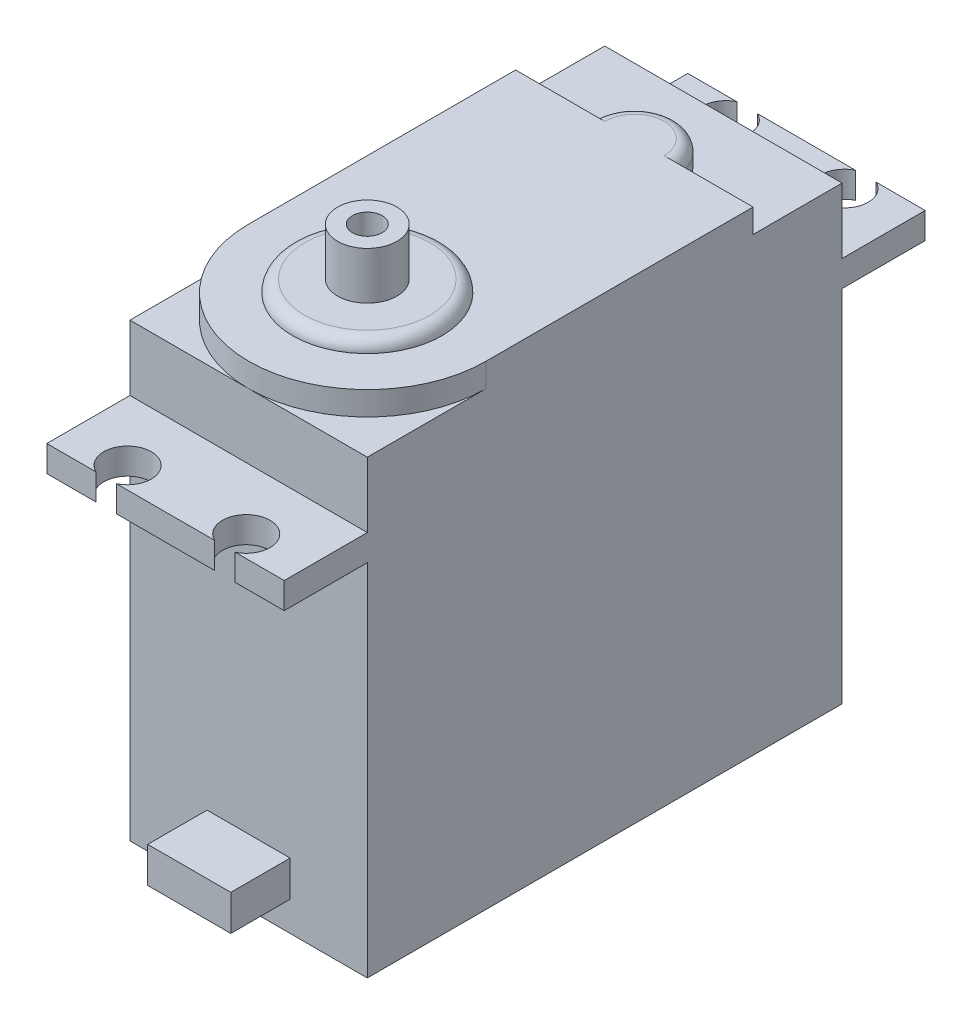
ISO-10303-21;
HEADER;
FILE_DESCRIPTION(('STEP AP214'),'2;1');
FILE_NAME('part.step','',(''),(''),'','','');
FILE_SCHEMA(('AUTOMOTIVE_DESIGN { 1 0 10303 214 1 1 1 1 }'));
ENDSEC;
DATA;
#1=APPLICATION_CONTEXT('core data for automotive mechanical design processes');
#2=APPLICATION_PROTOCOL_DEFINITION('international standard','automotive_design',2000,#1);
#3=PRODUCT_CONTEXT('',#1,'mechanical');
#4=PRODUCT('Part','Part','',(#3));
#5=PRODUCT_RELATED_PRODUCT_CATEGORY('part','',(#4));
#6=PRODUCT_DEFINITION_FORMATION('','',#4);
#7=PRODUCT_DEFINITION_CONTEXT('part definition',#1,'design');
#8=PRODUCT_DEFINITION('design','',#6,#7);
#9=PRODUCT_DEFINITION_SHAPE('','',#8);
#10=(LENGTH_UNIT() NAMED_UNIT(*) SI_UNIT(.MILLI.,.METRE.));
#11=(NAMED_UNIT(*) PLANE_ANGLE_UNIT() SI_UNIT($,.RADIAN.));
#12=(NAMED_UNIT(*) SI_UNIT($,.STERADIAN.) SOLID_ANGLE_UNIT());
#13=UNCERTAINTY_MEASURE_WITH_UNIT(LENGTH_MEASURE(1.E-05),#10,'distance_accuracy_value','');
#14=(GEOMETRIC_REPRESENTATION_CONTEXT(3) GLOBAL_UNCERTAINTY_ASSIGNED_CONTEXT((#13)) GLOBAL_UNIT_ASSIGNED_CONTEXT((#10,
#11,#12)) REPRESENTATION_CONTEXT('',''));
#15=CARTESIAN_POINT('',(0.,0.,0.));
#16=DIRECTION('',(0.,0.,1.));
#17=DIRECTION('',(1.,0.,0.));
#18=AXIS2_PLACEMENT_3D('',#15,#16,#17);
#19=CARTESIAN_POINT('',(0.,38.,0.));
#20=DIRECTION('',(0.,-1.,0.));
#21=DIRECTION('',(0.,0.,-1.));
#22=AXIS2_PLACEMENT_3D('',#19,#20,#21);
#23=PLANE('',#22);
#24=DIRECTION('',(-1.,0.,0.));
#25=VECTOR('',#24,1.);
#26=CARTESIAN_POINT('',(20.,38.,-32.5));
#27=LINE('',#26,#25);
#28=CARTESIAN_POINT('',(20.,38.,-32.5));
#29=VERTEX_POINT('',#28);
#30=CARTESIAN_POINT('',(13.5,38.,-32.5));
#31=VERTEX_POINT('',#30);
#32=EDGE_CURVE('E446',#29,#31,#27,.T.);
#33=ORIENTED_EDGE('',*,*,#32,.F.);
#34=DIRECTION('',(0.,0.,-1.));
#35=VECTOR('',#34,1.);
#36=CARTESIAN_POINT('',(20.,38.,0.));
#37=LINE('',#36,#35);
#38=CARTESIAN_POINT('',(20.,38.,-40.));
#39=VERTEX_POINT('',#38);
#40=EDGE_CURVE('E266',#29,#39,#37,.T.);
#41=ORIENTED_EDGE('',*,*,#40,.T.);
#42=DIRECTION('',(-1.,0.,0.));
#43=VECTOR('',#42,1.);
#44=CARTESIAN_POINT('',(0.,38.,-40.));
#45=LINE('',#44,#43);
#46=CARTESIAN_POINT('',(0.,38.,-40.));
#47=VERTEX_POINT('',#46);
#48=EDGE_CURVE('E395',#39,#47,#45,.T.);
#49=ORIENTED_EDGE('',*,*,#48,.T.);
#50=DIRECTION('',(0.,0.,1.));
#51=VECTOR('',#50,1.);
#52=CARTESIAN_POINT('',(0.,38.,0.));
#53=LINE('',#52,#51);
#54=CARTESIAN_POINT('',(0.,38.,-32.5));
#55=VERTEX_POINT('',#54);
#56=EDGE_CURVE('E386',#47,#55,#53,.T.);
#57=ORIENTED_EDGE('',*,*,#56,.T.);
#58=DIRECTION('',(-1.,0.,0.));
#59=VECTOR('',#58,1.);
#60=CARTESIAN_POINT('',(6.5,38.,-32.5));
#61=LINE('',#60,#59);
#62=CARTESIAN_POINT('',(6.5,38.,-32.5));
#63=VERTEX_POINT('',#62);
#64=EDGE_CURVE('E498',#63,#55,#61,.T.);
#65=ORIENTED_EDGE('',*,*,#64,.F.);
#66=CARTESIAN_POINT('',(10.,38.,-32.5));
#67=DIRECTION('',(0.,1.,0.));
#68=DIRECTION('',(0.,0.,1.));
#69=AXIS2_PLACEMENT_3D('',#66,#67,#68);
#70=CIRCLE('',#69,3.5);
#71=EDGE_CURVE('E522',#31,#63,#70,.T.);
#72=ORIENTED_EDGE('',*,*,#71,.F.);
#73=EDGE_LOOP('',(#33,#41,#49,#57,#65,#72));
#74=FACE_BOUND('',#73,.T.);
#75=ADVANCED_FACE('F36',(#74),#23,.F.);
#76=CARTESIAN_POINT('',(10.,38.,-10.));
#77=DIRECTION('',(0.,1.,0.));
#78=DIRECTION('',(0.,0.,1.));
#79=AXIS2_PLACEMENT_3D('',#76,#77,#78);
#80=CIRCLE('',#79,10.);
#81=CARTESIAN_POINT('',(0.,38.,-10.));
#82=VERTEX_POINT('',#81);
#83=CARTESIAN_POINT('',(10.,38.,0.));
#84=VERTEX_POINT('',#83);
#85=EDGE_CURVE('E260',#82,#84,#80,.T.);
#86=ORIENTED_EDGE('',*,*,#85,.F.);
#87=CARTESIAN_POINT('',(0.,38.,0.));
#88=VERTEX_POINT('',#87);
#89=EDGE_CURVE('E389',#82,#88,#53,.T.);
#90=ORIENTED_EDGE('',*,*,#89,.T.);
#91=DIRECTION('',(1.,0.,0.));
#92=VECTOR('',#91,1.);
#93=CARTESIAN_POINT('',(0.,38.,0.));
#94=LINE('',#93,#92);
#95=EDGE_CURVE('E390',#88,#84,#94,.T.);
#96=ORIENTED_EDGE('',*,*,#95,.T.);
#97=EDGE_LOOP('',(#86,#90,#96));
#98=FACE_BOUND('',#97,.T.);
#99=ADVANCED_FACE('F467',(#98),#23,.F.);
#100=CARTESIAN_POINT('',(0.,0.,-47.));
#101=DIRECTION('',(0.,0.,1.));
#102=DIRECTION('',(1.,0.,0.));
#103=AXIS2_PLACEMENT_3D('',#100,#101,#102);
#104=PLANE('',#103);
#105=DIRECTION('',(1.,0.,0.));
#106=VECTOR('',#105,1.);
#107=CARTESIAN_POINT('',(0.,30.3,-47.));
#108=LINE('',#107,#106);
#109=CARTESIAN_POINT('',(5.87177978870814,30.3,-47.));
#110=VERTEX_POINT('',#109);
#111=CARTESIAN_POINT('',(14.1282202112918,30.3,-47.));
#112=VERTEX_POINT('',#111);
#113=EDGE_CURVE('E321',#110,#112,#108,.T.);
#114=ORIENTED_EDGE('',*,*,#113,.F.);
#115=DIRECTION('',(0.,1.,0.));
#116=VECTOR('',#115,1.);
#117=CARTESIAN_POINT('',(5.87177978870814,25.5,-47.));
#118=LINE('',#117,#116);
#119=CARTESIAN_POINT('',(5.87177978870814,32.5,-47.));
#120=VERTEX_POINT('',#119);
#121=EDGE_CURVE('E294',#110,#120,#118,.T.);
#122=ORIENTED_EDGE('',*,*,#121,.T.);
#123=DIRECTION('',(-1.,0.,0.));
#124=VECTOR('',#123,1.);
#125=CARTESIAN_POINT('',(0.,32.5,-47.));
#126=LINE('',#125,#124);
#127=CARTESIAN_POINT('',(14.1282202112918,32.5,-47.));
#128=VERTEX_POINT('',#127);
#129=EDGE_CURVE('E329',#128,#120,#126,.T.);
#130=ORIENTED_EDGE('',*,*,#129,.F.);
#131=DIRECTION('',(0.,1.,0.));
#132=VECTOR('',#131,1.);
#133=CARTESIAN_POINT('',(14.1282202112918,25.5,-47.));
#134=LINE('',#133,#132);
#135=EDGE_CURVE('E283',#128,#112,#134,.F.);
#136=ORIENTED_EDGE('',*,*,#135,.T.);
#137=EDGE_LOOP('',(#114,#122,#130,#136));
#138=FACE_BOUND('',#137,.T.);
#139=ADVANCED_FACE('F474',(#138),#104,.F.);
#140=CARTESIAN_POINT('',(15.8717797887081,30.3,-47.));
#141=VERTEX_POINT('',#140);
#142=CARTESIAN_POINT('',(20.,30.3,-47.));
#143=VERTEX_POINT('',#142);
#144=EDGE_CURVE('E316',#141,#143,#108,.T.);
#145=ORIENTED_EDGE('',*,*,#144,.F.);
#146=DIRECTION('',(0.,1.,0.));
#147=VECTOR('',#146,1.);
#148=CARTESIAN_POINT('',(15.8717797887081,25.5,-47.));
#149=LINE('',#148,#147);
#150=CARTESIAN_POINT('',(15.8717797887081,32.5,-47.));
#151=VERTEX_POINT('',#150);
#152=EDGE_CURVE('E286',#141,#151,#149,.T.);
#153=ORIENTED_EDGE('',*,*,#152,.T.);
#154=CARTESIAN_POINT('',(20.,32.5,-47.));
#155=VERTEX_POINT('',#154);
#156=EDGE_CURVE('E325',#155,#151,#126,.T.);
#157=ORIENTED_EDGE('',*,*,#156,.F.);
#158=DIRECTION('',(0.,1.,0.));
#159=VECTOR('',#158,1.);
#160=CARTESIAN_POINT('',(20.,32.5,-47.));
#161=LINE('',#160,#159);
#162=EDGE_CURVE('E320',#143,#155,#161,.T.);
#163=ORIENTED_EDGE('',*,*,#162,.F.);
#164=EDGE_LOOP('',(#145,#153,#157,#163));
#165=FACE_BOUND('',#164,.T.);
#166=ADVANCED_FACE('F611',(#165),#104,.F.);
#167=CARTESIAN_POINT('',(0.,0.,7.));
#168=DIRECTION('',(0.,0.,1.));
#169=DIRECTION('',(1.,0.,0.));
#170=AXIS2_PLACEMENT_3D('',#167,#168,#169);
#171=PLANE('',#170);
#172=DIRECTION('',(0.,1.,0.));
#173=VECTOR('',#172,1.);
#174=CARTESIAN_POINT('',(15.8717797887082,25.5,7.));
#175=LINE('',#174,#173);
#176=CARTESIAN_POINT('',(15.8717797887082,30.3,7.));
#177=VERTEX_POINT('',#176);
#178=CARTESIAN_POINT('',(15.8717797887082,32.5,7.));
#179=VERTEX_POINT('',#178);
#180=EDGE_CURVE('E436',#177,#179,#175,.T.);
#181=ORIENTED_EDGE('',*,*,#180,.F.);
#182=DIRECTION('',(1.,0.,0.));
#183=VECTOR('',#182,1.);
#184=CARTESIAN_POINT('',(0.,30.3,7.));
#185=LINE('',#184,#183);
#186=CARTESIAN_POINT('',(20.,30.3,7.));
#187=VERTEX_POINT('',#186);
#188=EDGE_CURVE('E300',#177,#187,#185,.T.);
#189=ORIENTED_EDGE('',*,*,#188,.T.);
#190=DIRECTION('',(0.,1.,0.));
#191=VECTOR('',#190,1.);
#192=CARTESIAN_POINT('',(20.,32.5,7.));
#193=LINE('',#192,#191);
#194=CARTESIAN_POINT('',(20.,32.5,7.));
#195=VERTEX_POINT('',#194);
#196=EDGE_CURVE('E304',#187,#195,#193,.T.);
#197=ORIENTED_EDGE('',*,*,#196,.T.);
#198=DIRECTION('',(-1.,0.,0.));
#199=VECTOR('',#198,1.);
#200=CARTESIAN_POINT('',(0.,32.5,7.));
#201=LINE('',#200,#199);
#202=EDGE_CURVE('E309',#195,#179,#201,.T.);
#203=ORIENTED_EDGE('',*,*,#202,.T.);
#204=EDGE_LOOP('',(#181,#189,#197,#203));
#205=FACE_BOUND('',#204,.T.);
#206=ADVANCED_FACE('F604',(#205),#171,.T.);
#207=DIRECTION('',(0.,1.,0.));
#208=VECTOR('',#207,1.);
#209=CARTESIAN_POINT('',(14.1282202112919,25.5,7.));
#210=LINE('',#209,#208);
#211=CARTESIAN_POINT('',(14.1282202112919,32.5,7.));
#212=VERTEX_POINT('',#211);
#213=CARTESIAN_POINT('',(14.1282202112919,30.3,7.));
#214=VERTEX_POINT('',#213);
#215=EDGE_CURVE('E434',#212,#214,#210,.F.);
#216=ORIENTED_EDGE('',*,*,#215,.F.);
#217=CARTESIAN_POINT('',(5.87177978870814,32.5,7.));
#218=VERTEX_POINT('',#217);
#219=EDGE_CURVE('E313',#212,#218,#201,.T.);
#220=ORIENTED_EDGE('',*,*,#219,.T.);
#221=DIRECTION('',(0.,1.,0.));
#222=VECTOR('',#221,1.);
#223=CARTESIAN_POINT('',(5.87177978870814,25.5,7.));
#224=LINE('',#223,#222);
#225=CARTESIAN_POINT('',(5.87177978870814,30.3,7.));
#226=VERTEX_POINT('',#225);
#227=EDGE_CURVE('E432',#226,#218,#224,.T.);
#228=ORIENTED_EDGE('',*,*,#227,.F.);
#229=EDGE_CURVE('E305',#226,#214,#185,.T.);
#230=ORIENTED_EDGE('',*,*,#229,.T.);
#231=EDGE_LOOP('',(#216,#220,#228,#230));
#232=FACE_BOUND('',#231,.T.);
#233=ADVANCED_FACE('F600',(#232),#171,.T.);
#234=CARTESIAN_POINT('',(0.,38.,0.));
#235=DIRECTION('',(0.,0.,-1.));
#236=DIRECTION('',(-1.,0.,0.));
#237=AXIS2_PLACEMENT_3D('',#234,#235,#236);
#238=PLANE('',#237);
#239=DIRECTION('',(0.,-1.,0.));
#240=VECTOR('',#239,1.);
#241=CARTESIAN_POINT('',(0.,38.,0.));
#242=LINE('',#241,#240);
#243=CARTESIAN_POINT('',(0.,32.5,0.));
#244=VERTEX_POINT('',#243);
#245=EDGE_CURVE('E421',#88,#244,#242,.T.);
#246=ORIENTED_EDGE('',*,*,#245,.T.);
#247=DIRECTION('',(1.,0.,0.));
#248=VECTOR('',#247,1.);
#249=CARTESIAN_POINT('',(0.,32.5,0.));
#250=LINE('',#249,#248);
#251=CARTESIAN_POINT('',(20.,32.5,0.));
#252=VERTEX_POINT('',#251);
#253=EDGE_CURVE('E346',#244,#252,#250,.T.);
#254=ORIENTED_EDGE('',*,*,#253,.T.);
#255=DIRECTION('',(0.,-1.,0.));
#256=VECTOR('',#255,1.);
#257=CARTESIAN_POINT('',(20.,38.,0.));
#258=LINE('',#257,#256);
#259=CARTESIAN_POINT('',(20.,38.,0.));
#260=VERTEX_POINT('',#259);
#261=EDGE_CURVE('E417',#260,#252,#258,.T.);
#262=ORIENTED_EDGE('',*,*,#261,.F.);
#263=EDGE_CURVE('E388',#84,#260,#94,.T.);
#264=ORIENTED_EDGE('',*,*,#263,.F.);
#265=ORIENTED_EDGE('',*,*,#95,.F.);
#266=EDGE_LOOP('',(#246,#254,#262,#264,#265));
#267=FACE_BOUND('',#266,.T.);
#268=ADVANCED_FACE('F502',(#267),#238,.F.);
#269=CARTESIAN_POINT('',(0.,38.,-40.));
#270=DIRECTION('',(0.,0.,1.));
#271=DIRECTION('',(1.,0.,0.));
#272=AXIS2_PLACEMENT_3D('',#269,#270,#271);
#273=PLANE('',#272);
#274=DIRECTION('',(0.,-1.,0.));
#275=VECTOR('',#274,1.);
#276=CARTESIAN_POINT('',(20.,38.,-40.));
#277=LINE('',#276,#275);
#278=CARTESIAN_POINT('',(20.,32.5,-40.));
#279=VERTEX_POINT('',#278);
#280=EDGE_CURVE('E413',#39,#279,#277,.T.);
#281=ORIENTED_EDGE('',*,*,#280,.T.);
#282=DIRECTION('',(-1.,0.,0.));
#283=VECTOR('',#282,1.);
#284=CARTESIAN_POINT('',(0.,32.5,-40.));
#285=LINE('',#284,#283);
#286=CARTESIAN_POINT('',(0.,32.5,-40.));
#287=VERTEX_POINT('',#286);
#288=EDGE_CURVE('E427',#279,#287,#285,.T.);
#289=ORIENTED_EDGE('',*,*,#288,.T.);
#290=DIRECTION('',(0.,-1.,0.));
#291=VECTOR('',#290,1.);
#292=CARTESIAN_POINT('',(0.,38.,-40.));
#293=LINE('',#292,#291);
#294=EDGE_CURVE('E409',#47,#287,#293,.T.);
#295=ORIENTED_EDGE('',*,*,#294,.F.);
#296=ORIENTED_EDGE('',*,*,#48,.F.);
#297=EDGE_LOOP('',(#281,#289,#295,#296));
#298=FACE_BOUND('',#297,.T.);
#299=ADVANCED_FACE('F490',(#298),#273,.F.);
#300=CARTESIAN_POINT('',(20.,30.3,0.));
#301=VERTEX_POINT('',#300);
#302=CARTESIAN_POINT('',(20.,0.,0.));
#303=VERTEX_POINT('',#302);
#304=EDGE_CURVE('E416',#301,#303,#258,.T.);
#305=ORIENTED_EDGE('',*,*,#304,.F.);
#306=DIRECTION('',(-1.,0.,0.));
#307=VECTOR('',#306,1.);
#308=CARTESIAN_POINT('',(0.,30.3,0.));
#309=LINE('',#308,#307);
#310=CARTESIAN_POINT('',(0.,30.3,0.));
#311=VERTEX_POINT('',#310);
#312=EDGE_CURVE('E332',#301,#311,#309,.T.);
#313=ORIENTED_EDGE('',*,*,#312,.T.);
#314=CARTESIAN_POINT('',(0.,0.,0.));
#315=VERTEX_POINT('',#314);
#316=EDGE_CURVE('E420',#311,#315,#242,.T.);
#317=ORIENTED_EDGE('',*,*,#316,.T.);
#318=DIRECTION('',(1.,0.,0.));
#319=VECTOR('',#318,1.);
#320=CARTESIAN_POINT('',(0.,0.,0.));
#321=LINE('',#320,#319);
#322=EDGE_CURVE('E400',#315,#303,#321,.T.);
#323=ORIENTED_EDGE('',*,*,#322,.T.);
#324=EDGE_LOOP('',(#305,#313,#317,#323));
#325=FACE_BOUND('',#324,.T.);
#326=DIRECTION('',(0.,-1.,0.));
#327=VECTOR('',#326,1.);
#328=CARTESIAN_POINT('',(6.5,2.5,0.));
#329=LINE('',#328,#327);
#330=CARTESIAN_POINT('',(6.5,5.5,0.));
#331=VERTEX_POINT('',#330);
#332=CARTESIAN_POINT('',(6.5,2.5,0.));
#333=VERTEX_POINT('',#332);
#334=EDGE_CURVE('E352',#331,#333,#329,.T.);
#335=ORIENTED_EDGE('',*,*,#334,.F.);
#336=DIRECTION('',(-1.,0.,0.));
#337=VECTOR('',#336,1.);
#338=CARTESIAN_POINT('',(6.5,5.5,0.));
#339=LINE('',#338,#337);
#340=CARTESIAN_POINT('',(13.5,5.5,0.));
#341=VERTEX_POINT('',#340);
#342=EDGE_CURVE('E357',#341,#331,#339,.T.);
#343=ORIENTED_EDGE('',*,*,#342,.F.);
#344=DIRECTION('',(0.,1.,0.));
#345=VECTOR('',#344,1.);
#346=CARTESIAN_POINT('',(13.5,2.5,0.));
#347=LINE('',#346,#345);
#348=CARTESIAN_POINT('',(13.5,2.5,0.));
#349=VERTEX_POINT('',#348);
#350=EDGE_CURVE('E369',#349,#341,#347,.T.);
#351=ORIENTED_EDGE('',*,*,#350,.F.);
#352=DIRECTION('',(1.,0.,0.));
#353=VECTOR('',#352,1.);
#354=CARTESIAN_POINT('',(6.5,2.5,0.));
#355=LINE('',#354,#353);
#356=EDGE_CURVE('E366',#333,#349,#355,.T.);
#357=ORIENTED_EDGE('',*,*,#356,.F.);
#358=EDGE_LOOP('',(#335,#343,#351,#357));
#359=FACE_BOUND('',#358,.T.);
#360=ADVANCED_FACE('F581',(#325,#359),#238,.F.);
#361=CARTESIAN_POINT('',(0.,38.,0.));
#362=DIRECTION('',(1.,0.,0.));
#363=DIRECTION('',(0.,0.,-1.));
#364=AXIS2_PLACEMENT_3D('',#361,#362,#363);
#365=PLANE('',#364);
#366=ORIENTED_EDGE('',*,*,#316,.F.);
#367=DIRECTION('',(0.,0.,1.));
#368=VECTOR('',#367,1.);
#369=CARTESIAN_POINT('',(0.,30.3,-47.));
#370=LINE('',#369,#368);
#371=CARTESIAN_POINT('',(0.,30.3,7.));
#372=VERTEX_POINT('',#371);
#373=EDGE_CURVE('E328',#311,#372,#370,.T.);
#374=ORIENTED_EDGE('',*,*,#373,.T.);
#375=DIRECTION('',(0.,-1.,0.));
#376=VECTOR('',#375,1.);
#377=CARTESIAN_POINT('',(0.,32.5,7.));
#378=LINE('',#377,#376);
#379=CARTESIAN_POINT('',(0.,32.5,7.));
#380=VERTEX_POINT('',#379);
#381=EDGE_CURVE('E297',#380,#372,#378,.T.);
#382=ORIENTED_EDGE('',*,*,#381,.F.);
#383=DIRECTION('',(0.,0.,1.));
#384=VECTOR('',#383,1.);
#385=CARTESIAN_POINT('',(0.,32.5,-47.));
#386=LINE('',#385,#384);
#387=EDGE_CURVE('E333',#244,#380,#386,.T.);
#388=ORIENTED_EDGE('',*,*,#387,.F.);
#389=ORIENTED_EDGE('',*,*,#245,.F.);
#390=ORIENTED_EDGE('',*,*,#89,.F.);
#391=DIRECTION('',(0.,-1.,0.));
#392=VECTOR('',#391,1.);
#393=CARTESIAN_POINT('',(0.,40.,-10.));
#394=LINE('',#393,#392);
#395=CARTESIAN_POINT('',(0.,40.,-10.));
#396=VERTEX_POINT('',#395);
#397=EDGE_CURVE('E508',#396,#82,#394,.T.);
#398=ORIENTED_EDGE('',*,*,#397,.F.);
#399=DIRECTION('',(0.,0.,1.));
#400=VECTOR('',#399,1.);
#401=CARTESIAN_POINT('',(0.,40.,-32.5));
#402=LINE('',#401,#400);
#403=CARTESIAN_POINT('',(0.,40.,-32.5));
#404=VERTEX_POINT('',#403);
#405=EDGE_CURVE('E528',#404,#396,#402,.T.);
#406=ORIENTED_EDGE('',*,*,#405,.F.);
#407=DIRECTION('',(0.,-1.,0.));
#408=VECTOR('',#407,1.);
#409=CARTESIAN_POINT('',(0.,40.,-32.5));
#410=LINE('',#409,#408);
#411=EDGE_CURVE('E515',#404,#55,#410,.T.);
#412=ORIENTED_EDGE('',*,*,#411,.T.);
#413=ORIENTED_EDGE('',*,*,#56,.F.);
#414=ORIENTED_EDGE('',*,*,#294,.T.);
#415=CARTESIAN_POINT('',(0.,32.5,-47.));
#416=VERTEX_POINT('',#415);
#417=EDGE_CURVE('E330',#416,#287,#386,.T.);
#418=ORIENTED_EDGE('',*,*,#417,.F.);
#419=DIRECTION('',(0.,-1.,0.));
#420=VECTOR('',#419,1.);
#421=CARTESIAN_POINT('',(0.,32.5,-47.));
#422=LINE('',#421,#420);
#423=CARTESIAN_POINT('',(0.,30.3,-47.));
#424=VERTEX_POINT('',#423);
#425=EDGE_CURVE('E312',#416,#424,#422,.T.);
#426=ORIENTED_EDGE('',*,*,#425,.T.);
#427=CARTESIAN_POINT('',(0.,30.3,-40.));
#428=VERTEX_POINT('',#427);
#429=EDGE_CURVE('E341',#424,#428,#370,.T.);
#430=ORIENTED_EDGE('',*,*,#429,.T.);
#431=CARTESIAN_POINT('',(0.,0.,-40.));
#432=VERTEX_POINT('',#431);
#433=EDGE_CURVE('E397',#428,#432,#293,.T.);
#434=ORIENTED_EDGE('',*,*,#433,.T.);
#435=DIRECTION('',(0.,0.,1.));
#436=VECTOR('',#435,1.);
#437=CARTESIAN_POINT('',(0.,0.,0.));
#438=LINE('',#437,#436);
#439=EDGE_CURVE('E385',#432,#315,#438,.T.);
#440=ORIENTED_EDGE('',*,*,#439,.T.);
#441=EDGE_LOOP('',(#366,#374,#382,#388,#389,#390,#398,#406,#412,#413,#414,#418,#426,#430,#434,#440));
#442=FACE_BOUND('',#441,.T.);
#443=ADVANCED_FACE('F587',(#442),#365,.F.);
#444=CARTESIAN_POINT('',(20.,38.,0.));
#445=DIRECTION('',(-1.,0.,0.));
#446=DIRECTION('',(0.,0.,1.));
#447=AXIS2_PLACEMENT_3D('',#444,#445,#446);
#448=PLANE('',#447);
#449=CARTESIAN_POINT('',(20.,30.3,-40.));
#450=VERTEX_POINT('',#449);
#451=CARTESIAN_POINT('',(20.,0.,-40.));
#452=VERTEX_POINT('',#451);
#453=EDGE_CURVE('E412',#450,#452,#277,.T.);
#454=ORIENTED_EDGE('',*,*,#453,.F.);
#455=DIRECTION('',(0.,0.,1.));
#456=VECTOR('',#455,1.);
#457=CARTESIAN_POINT('',(20.,30.3,-47.));
#458=LINE('',#457,#456);
#459=EDGE_CURVE('E338',#143,#450,#458,.T.);
#460=ORIENTED_EDGE('',*,*,#459,.F.);
#461=ORIENTED_EDGE('',*,*,#162,.T.);
#462=DIRECTION('',(0.,0.,1.));
#463=VECTOR('',#462,1.);
#464=CARTESIAN_POINT('',(20.,32.5,-47.));
#465=LINE('',#464,#463);
#466=EDGE_CURVE('E334',#155,#279,#465,.T.);
#467=ORIENTED_EDGE('',*,*,#466,.T.);
#468=ORIENTED_EDGE('',*,*,#280,.F.);
#469=ORIENTED_EDGE('',*,*,#40,.F.);
#470=DIRECTION('',(0.,-1.,0.));
#471=VECTOR('',#470,1.);
#472=CARTESIAN_POINT('',(20.,40.,-32.5));
#473=LINE('',#472,#471);
#474=CARTESIAN_POINT('',(20.,40.,-32.5));
#475=VERTEX_POINT('',#474);
#476=EDGE_CURVE('E245',#475,#29,#473,.T.);
#477=ORIENTED_EDGE('',*,*,#476,.F.);
#478=DIRECTION('',(0.,0.,-1.));
#479=VECTOR('',#478,1.);
#480=CARTESIAN_POINT('',(20.,40.,-32.5));
#481=LINE('',#480,#479);
#482=CARTESIAN_POINT('',(20.,40.,-10.));
#483=VERTEX_POINT('',#482);
#484=EDGE_CURVE('E251',#483,#475,#481,.T.);
#485=ORIENTED_EDGE('',*,*,#484,.F.);
#486=DIRECTION('',(0.,-1.,0.));
#487=VECTOR('',#486,1.);
#488=CARTESIAN_POINT('',(20.,40.,-10.));
#489=LINE('',#488,#487);
#490=CARTESIAN_POINT('',(20.,38.,-10.));
#491=VERTEX_POINT('',#490);
#492=EDGE_CURVE('E512',#483,#491,#489,.T.);
#493=ORIENTED_EDGE('',*,*,#492,.T.);
#494=EDGE_CURVE('E393',#260,#491,#37,.T.);
#495=ORIENTED_EDGE('',*,*,#494,.F.);
#496=ORIENTED_EDGE('',*,*,#261,.T.);
#497=EDGE_CURVE('E337',#252,#195,#465,.T.);
#498=ORIENTED_EDGE('',*,*,#497,.T.);
#499=ORIENTED_EDGE('',*,*,#196,.F.);
#500=EDGE_CURVE('E340',#301,#187,#458,.T.);
#501=ORIENTED_EDGE('',*,*,#500,.F.);
#502=ORIENTED_EDGE('',*,*,#304,.T.);
#503=DIRECTION('',(0.,0.,-1.));
#504=VECTOR('',#503,1.);
#505=CARTESIAN_POINT('',(20.,0.,0.));
#506=LINE('',#505,#504);
#507=EDGE_CURVE('E403',#303,#452,#506,.T.);
#508=ORIENTED_EDGE('',*,*,#507,.T.);
#509=EDGE_LOOP('',(#454,#460,#461,#467,#468,#469,#477,#485,#493,#495,#496,#498,#499,#501,#502,#508));
#510=FACE_BOUND('',#509,.T.);
#511=ADVANCED_FACE('F264',(#510),#448,.F.);
#512=ORIENTED_EDGE('',*,*,#433,.F.);
#513=DIRECTION('',(1.,0.,0.));
#514=VECTOR('',#513,1.);
#515=CARTESIAN_POINT('',(0.,30.3,-40.));
#516=LINE('',#515,#514);
#517=EDGE_CURVE('E424',#428,#450,#516,.T.);
#518=ORIENTED_EDGE('',*,*,#517,.T.);
#519=ORIENTED_EDGE('',*,*,#453,.T.);
#520=DIRECTION('',(-1.,0.,0.));
#521=VECTOR('',#520,1.);
#522=CARTESIAN_POINT('',(0.,0.,-40.));
#523=LINE('',#522,#521);
#524=EDGE_CURVE('E406',#452,#432,#523,.T.);
#525=ORIENTED_EDGE('',*,*,#524,.T.);
#526=EDGE_LOOP('',(#512,#518,#519,#525));
#527=FACE_BOUND('',#526,.T.);
#528=ADVANCED_FACE('F480',(#527),#273,.F.);
#529=EDGE_CURVE('E492',#84,#491,#80,.T.);
#530=ORIENTED_EDGE('',*,*,#529,.F.);
#531=ORIENTED_EDGE('',*,*,#263,.T.);
#532=ORIENTED_EDGE('',*,*,#494,.T.);
#533=EDGE_LOOP('',(#530,#531,#532));
#534=FACE_BOUND('',#533,.T.);
#535=ADVANCED_FACE('F470',(#534),#23,.F.);
#536=CARTESIAN_POINT('',(0.,0.,0.));
#537=DIRECTION('',(0.,-1.,0.));
#538=DIRECTION('',(0.,0.,-1.));
#539=AXIS2_PLACEMENT_3D('',#536,#537,#538);
#540=PLANE('',#539);
#541=ORIENTED_EDGE('',*,*,#439,.F.);
#542=ORIENTED_EDGE('',*,*,#524,.F.);
#543=ORIENTED_EDGE('',*,*,#507,.F.);
#544=ORIENTED_EDGE('',*,*,#322,.F.);
#545=EDGE_LOOP('',(#541,#542,#543,#544));
#546=FACE_BOUND('',#545,.T.);
#547=ADVANCED_FACE('F479',(#546),#540,.T.);
#548=CARTESIAN_POINT('',(6.5,2.5,5.));
#549=DIRECTION('',(1.,0.,0.));
#550=DIRECTION('',(0.,0.,-1.));
#551=AXIS2_PLACEMENT_3D('',#548,#549,#550);
#552=PLANE('',#551);
#553=ORIENTED_EDGE('',*,*,#334,.T.);
#554=DIRECTION('',(0.,0.,-1.));
#555=VECTOR('',#554,1.);
#556=CARTESIAN_POINT('',(6.5,2.5,5.));
#557=LINE('',#556,#555);
#558=CARTESIAN_POINT('',(6.5,2.5,5.));
#559=VERTEX_POINT('',#558);
#560=EDGE_CURVE('E382',#559,#333,#557,.T.);
#561=ORIENTED_EDGE('',*,*,#560,.F.);
#562=DIRECTION('',(0.,-1.,0.));
#563=VECTOR('',#562,1.);
#564=CARTESIAN_POINT('',(6.5,2.5,5.));
#565=LINE('',#564,#563);
#566=CARTESIAN_POINT('',(6.5,5.5,5.));
#567=VERTEX_POINT('',#566);
#568=EDGE_CURVE('E353',#567,#559,#565,.T.);
#569=ORIENTED_EDGE('',*,*,#568,.F.);
#570=DIRECTION('',(0.,0.,-1.));
#571=VECTOR('',#570,1.);
#572=CARTESIAN_POINT('',(6.5,5.5,5.));
#573=LINE('',#572,#571);
#574=EDGE_CURVE('E363',#567,#331,#573,.T.);
#575=ORIENTED_EDGE('',*,*,#574,.T.);
#576=EDGE_LOOP('',(#553,#561,#569,#575));
#577=FACE_BOUND('',#576,.T.);
#578=ADVANCED_FACE('F486',(#577),#552,.F.);
#579=CARTESIAN_POINT('',(6.5,2.5,5.));
#580=DIRECTION('',(0.,1.,0.));
#581=DIRECTION('',(0.,0.,1.));
#582=AXIS2_PLACEMENT_3D('',#579,#580,#581);
#583=PLANE('',#582);
#584=ORIENTED_EDGE('',*,*,#356,.T.);
#585=DIRECTION('',(0.,0.,-1.));
#586=VECTOR('',#585,1.);
#587=CARTESIAN_POINT('',(13.5,2.5,5.));
#588=LINE('',#587,#586);
#589=CARTESIAN_POINT('',(13.5,2.5,5.));
#590=VERTEX_POINT('',#589);
#591=EDGE_CURVE('E379',#590,#349,#588,.T.);
#592=ORIENTED_EDGE('',*,*,#591,.F.);
#593=DIRECTION('',(1.,0.,0.));
#594=VECTOR('',#593,1.);
#595=CARTESIAN_POINT('',(6.5,2.5,5.));
#596=LINE('',#595,#594);
#597=EDGE_CURVE('E356',#559,#590,#596,.T.);
#598=ORIENTED_EDGE('',*,*,#597,.F.);
#599=ORIENTED_EDGE('',*,*,#560,.T.);
#600=EDGE_LOOP('',(#584,#592,#598,#599));
#601=FACE_BOUND('',#600,.T.);
#602=ADVANCED_FACE('F569',(#601),#583,.F.);
#603=CARTESIAN_POINT('',(13.5,2.5,5.));
#604=DIRECTION('',(-1.,0.,0.));
#605=DIRECTION('',(0.,0.,1.));
#606=AXIS2_PLACEMENT_3D('',#603,#604,#605);
#607=PLANE('',#606);
#608=ORIENTED_EDGE('',*,*,#350,.T.);
#609=DIRECTION('',(0.,0.,-1.));
#610=VECTOR('',#609,1.);
#611=CARTESIAN_POINT('',(13.5,5.5,5.));
#612=LINE('',#611,#610);
#613=CARTESIAN_POINT('',(13.5,5.5,5.));
#614=VERTEX_POINT('',#613);
#615=EDGE_CURVE('E376',#614,#341,#612,.T.);
#616=ORIENTED_EDGE('',*,*,#615,.F.);
#617=DIRECTION('',(0.,1.,0.));
#618=VECTOR('',#617,1.);
#619=CARTESIAN_POINT('',(13.5,2.5,5.));
#620=LINE('',#619,#618);
#621=EDGE_CURVE('E359',#590,#614,#620,.T.);
#622=ORIENTED_EDGE('',*,*,#621,.F.);
#623=ORIENTED_EDGE('',*,*,#591,.T.);
#624=EDGE_LOOP('',(#608,#616,#622,#623));
#625=FACE_BOUND('',#624,.T.);
#626=ADVANCED_FACE('F565',(#625),#607,.F.);
#627=CARTESIAN_POINT('',(6.5,5.5,5.));
#628=DIRECTION('',(0.,-1.,0.));
#629=DIRECTION('',(0.,0.,-1.));
#630=AXIS2_PLACEMENT_3D('',#627,#628,#629);
#631=PLANE('',#630);
#632=ORIENTED_EDGE('',*,*,#342,.T.);
#633=ORIENTED_EDGE('',*,*,#574,.F.);
#634=DIRECTION('',(-1.,0.,0.));
#635=VECTOR('',#634,1.);
#636=CARTESIAN_POINT('',(6.5,5.5,5.));
#637=LINE('',#636,#635);
#638=EDGE_CURVE('E361',#614,#567,#637,.T.);
#639=ORIENTED_EDGE('',*,*,#638,.F.);
#640=ORIENTED_EDGE('',*,*,#615,.T.);
#641=EDGE_LOOP('',(#632,#633,#639,#640));
#642=FACE_BOUND('',#641,.T.);
#643=ADVANCED_FACE('F561',(#642),#631,.F.);
#644=CARTESIAN_POINT('',(0.,0.,5.));
#645=DIRECTION('',(0.,0.,-1.));
#646=DIRECTION('',(-1.,0.,0.));
#647=AXIS2_PLACEMENT_3D('',#644,#645,#646);
#648=PLANE('',#647);
#649=ORIENTED_EDGE('',*,*,#568,.T.);
#650=ORIENTED_EDGE('',*,*,#597,.T.);
#651=ORIENTED_EDGE('',*,*,#621,.T.);
#652=ORIENTED_EDGE('',*,*,#638,.T.);
#653=EDGE_LOOP('',(#649,#650,#651,#652));
#654=FACE_BOUND('',#653,.T.);
#655=ADVANCED_FACE('F557',(#654),#648,.F.);
#656=CARTESIAN_POINT('',(4.12822021129186,32.5,-47.));
#657=VERTEX_POINT('',#656);
#658=EDGE_CURVE('E324',#657,#416,#126,.T.);
#659=ORIENTED_EDGE('',*,*,#658,.F.);
#660=DIRECTION('',(0.,1.,0.));
#661=VECTOR('',#660,1.);
#662=CARTESIAN_POINT('',(4.12822021129186,25.5,-47.));
#663=LINE('',#662,#661);
#664=CARTESIAN_POINT('',(4.12822021129186,30.3,-47.));
#665=VERTEX_POINT('',#664);
#666=EDGE_CURVE('E291',#657,#665,#663,.F.);
#667=ORIENTED_EDGE('',*,*,#666,.T.);
#668=EDGE_CURVE('E317',#424,#665,#108,.T.);
#669=ORIENTED_EDGE('',*,*,#668,.F.);
#670=ORIENTED_EDGE('',*,*,#425,.F.);
#671=EDGE_LOOP('',(#659,#667,#669,#670));
#672=FACE_BOUND('',#671,.T.);
#673=ADVANCED_FACE('F560',(#672),#104,.F.);
#674=CARTESIAN_POINT('',(0.,30.3,-47.));
#675=DIRECTION('',(0.,-1.,0.));
#676=DIRECTION('',(0.,0.,-1.));
#677=AXIS2_PLACEMENT_3D('',#674,#675,#676);
#678=PLANE('',#677);
#679=CARTESIAN_POINT('',(5.,30.3,-45.2));
#680=DIRECTION('',(0.,-1.,0.));
#681=DIRECTION('',(0.,0.,-1.));
#682=AXIS2_PLACEMENT_3D('',#679,#680,#681);
#683=CIRCLE('',#682,2.00000000000001);
#684=EDGE_CURVE('E289',#110,#665,#683,.T.);
#685=ORIENTED_EDGE('',*,*,#684,.F.);
#686=ORIENTED_EDGE('',*,*,#113,.T.);
#687=CARTESIAN_POINT('',(15.,30.3,-45.2));
#688=DIRECTION('',(0.,-1.,0.));
#689=DIRECTION('',(0.,0.,-1.));
#690=AXIS2_PLACEMENT_3D('',#687,#688,#689);
#691=CIRCLE('',#690,2.00000000000001);
#692=EDGE_CURVE('E281',#141,#112,#691,.T.);
#693=ORIENTED_EDGE('',*,*,#692,.F.);
#694=ORIENTED_EDGE('',*,*,#144,.T.);
#695=ORIENTED_EDGE('',*,*,#459,.T.);
#696=ORIENTED_EDGE('',*,*,#517,.F.);
#697=ORIENTED_EDGE('',*,*,#429,.F.);
#698=ORIENTED_EDGE('',*,*,#668,.T.);
#699=EDGE_LOOP('',(#685,#686,#693,#694,#695,#696,#697,#698));
#700=FACE_BOUND('',#699,.T.);
#701=ADVANCED_FACE('F629',(#700),#678,.T.);
#702=CARTESIAN_POINT('',(0.,32.5,-47.));
#703=DIRECTION('',(0.,1.,0.));
#704=DIRECTION('',(0.,0.,1.));
#705=AXIS2_PLACEMENT_3D('',#702,#703,#704);
#706=PLANE('',#705);
#707=CARTESIAN_POINT('',(5.,32.5,-45.2));
#708=DIRECTION('',(0.,1.,0.));
#709=DIRECTION('',(0.,0.,1.));
#710=AXIS2_PLACEMENT_3D('',#707,#708,#709);
#711=CIRCLE('',#710,2.00000000000001);
#712=EDGE_CURVE('E440',#657,#120,#711,.T.);
#713=ORIENTED_EDGE('',*,*,#712,.F.);
#714=ORIENTED_EDGE('',*,*,#658,.T.);
#715=ORIENTED_EDGE('',*,*,#417,.T.);
#716=ORIENTED_EDGE('',*,*,#288,.F.);
#717=ORIENTED_EDGE('',*,*,#466,.F.);
#718=ORIENTED_EDGE('',*,*,#156,.T.);
#719=CARTESIAN_POINT('',(15.,32.5,-45.2));
#720=DIRECTION('',(0.,1.,0.));
#721=DIRECTION('',(0.,0.,1.));
#722=AXIS2_PLACEMENT_3D('',#719,#720,#721);
#723=CIRCLE('',#722,2.00000000000001);
#724=EDGE_CURVE('E438',#128,#151,#723,.T.);
#725=ORIENTED_EDGE('',*,*,#724,.F.);
#726=ORIENTED_EDGE('',*,*,#129,.T.);
#727=EDGE_LOOP('',(#713,#714,#715,#716,#717,#718,#725,#726));
#728=FACE_BOUND('',#727,.T.);
#729=ADVANCED_FACE('F760',(#728),#706,.T.);
#730=CARTESIAN_POINT('',(15.,32.5,5.2));
#731=DIRECTION('',(0.,1.,0.));
#732=DIRECTION('',(0.,0.,1.));
#733=AXIS2_PLACEMENT_3D('',#730,#731,#732);
#734=CIRCLE('',#733,2.00000000000001);
#735=EDGE_CURVE('E270',#179,#212,#734,.T.);
#736=ORIENTED_EDGE('',*,*,#735,.F.);
#737=ORIENTED_EDGE('',*,*,#202,.F.);
#738=ORIENTED_EDGE('',*,*,#497,.F.);
#739=ORIENTED_EDGE('',*,*,#253,.F.);
#740=ORIENTED_EDGE('',*,*,#387,.T.);
#741=CARTESIAN_POINT('',(4.12822021129186,32.5,7.));
#742=VERTEX_POINT('',#741);
#743=EDGE_CURVE('E308',#742,#380,#201,.T.);
#744=ORIENTED_EDGE('',*,*,#743,.F.);
#745=CARTESIAN_POINT('',(5.,32.5,5.2));
#746=DIRECTION('',(0.,1.,0.));
#747=DIRECTION('',(0.,0.,1.));
#748=AXIS2_PLACEMENT_3D('',#745,#746,#747);
#749=CIRCLE('',#748,2.);
#750=EDGE_CURVE('E267',#218,#742,#749,.T.);
#751=ORIENTED_EDGE('',*,*,#750,.F.);
#752=ORIENTED_EDGE('',*,*,#219,.F.);
#753=EDGE_LOOP('',(#736,#737,#738,#739,#740,#744,#751,#752));
#754=FACE_BOUND('',#753,.T.);
#755=ADVANCED_FACE('F627',(#754),#706,.T.);
#756=CARTESIAN_POINT('',(15.,30.3,5.2));
#757=DIRECTION('',(0.,-1.,0.));
#758=DIRECTION('',(0.,0.,-1.));
#759=AXIS2_PLACEMENT_3D('',#756,#757,#758);
#760=CIRCLE('',#759,2.00000000000001);
#761=EDGE_CURVE('E279',#214,#177,#760,.T.);
#762=ORIENTED_EDGE('',*,*,#761,.F.);
#763=ORIENTED_EDGE('',*,*,#229,.F.);
#764=CARTESIAN_POINT('',(5.,30.3,5.2));
#765=DIRECTION('',(0.,-1.,0.));
#766=DIRECTION('',(0.,0.,-1.));
#767=AXIS2_PLACEMENT_3D('',#764,#765,#766);
#768=CIRCLE('',#767,2.);
#769=CARTESIAN_POINT('',(4.12822021129186,30.3,7.));
#770=VERTEX_POINT('',#769);
#771=EDGE_CURVE('E277',#770,#226,#768,.T.);
#772=ORIENTED_EDGE('',*,*,#771,.F.);
#773=EDGE_CURVE('E301',#372,#770,#185,.T.);
#774=ORIENTED_EDGE('',*,*,#773,.F.);
#775=ORIENTED_EDGE('',*,*,#373,.F.);
#776=ORIENTED_EDGE('',*,*,#312,.F.);
#777=ORIENTED_EDGE('',*,*,#500,.T.);
#778=ORIENTED_EDGE('',*,*,#188,.F.);
#779=EDGE_LOOP('',(#762,#763,#772,#774,#775,#776,#777,#778));
#780=FACE_BOUND('',#779,.T.);
#781=ADVANCED_FACE('F618',(#780),#678,.T.);
#782=DIRECTION('',(0.,1.,0.));
#783=VECTOR('',#782,1.);
#784=CARTESIAN_POINT('',(4.12822021129186,25.5,7.));
#785=LINE('',#784,#783);
#786=EDGE_CURVE('E430',#742,#770,#785,.F.);
#787=ORIENTED_EDGE('',*,*,#786,.F.);
#788=ORIENTED_EDGE('',*,*,#743,.T.);
#789=ORIENTED_EDGE('',*,*,#381,.T.);
#790=ORIENTED_EDGE('',*,*,#773,.T.);
#791=EDGE_LOOP('',(#787,#788,#789,#790));
#792=FACE_BOUND('',#791,.T.);
#793=ADVANCED_FACE('F607',(#792),#171,.T.);
#794=CARTESIAN_POINT('',(5.,25.5,5.2));
#795=DIRECTION('',(0.,1.,0.));
#796=DIRECTION('',(0.,0.,1.));
#797=AXIS2_PLACEMENT_3D('',#794,#795,#796);
#798=CYLINDRICAL_SURFACE('',#797,2.);
#799=ORIENTED_EDGE('',*,*,#227,.T.);
#800=ORIENTED_EDGE('',*,*,#750,.T.);
#801=ORIENTED_EDGE('',*,*,#786,.T.);
#802=ORIENTED_EDGE('',*,*,#771,.T.);
#803=EDGE_LOOP('',(#799,#800,#801,#802));
#804=FACE_BOUND('',#803,.T.);
#805=ADVANCED_FACE('F617',(#804),#798,.F.);
#806=CARTESIAN_POINT('',(15.,25.5,5.2));
#807=DIRECTION('',(0.,1.,0.));
#808=DIRECTION('',(0.,0.,1.));
#809=AXIS2_PLACEMENT_3D('',#806,#807,#808);
#810=CYLINDRICAL_SURFACE('',#809,2.00000000000001);
#811=ORIENTED_EDGE('',*,*,#180,.T.);
#812=ORIENTED_EDGE('',*,*,#735,.T.);
#813=ORIENTED_EDGE('',*,*,#215,.T.);
#814=ORIENTED_EDGE('',*,*,#761,.T.);
#815=EDGE_LOOP('',(#811,#812,#813,#814));
#816=FACE_BOUND('',#815,.T.);
#817=ADVANCED_FACE('F624',(#816),#810,.F.);
#818=CARTESIAN_POINT('',(15.,25.5,-45.2));
#819=DIRECTION('',(0.,1.,0.));
#820=DIRECTION('',(0.,0.,1.));
#821=AXIS2_PLACEMENT_3D('',#818,#819,#820);
#822=CYLINDRICAL_SURFACE('',#821,2.00000000000001);
#823=ORIENTED_EDGE('',*,*,#692,.T.);
#824=ORIENTED_EDGE('',*,*,#135,.F.);
#825=ORIENTED_EDGE('',*,*,#724,.T.);
#826=ORIENTED_EDGE('',*,*,#152,.F.);
#827=EDGE_LOOP('',(#823,#824,#825,#826));
#828=FACE_BOUND('',#827,.T.);
#829=ADVANCED_FACE('F655',(#828),#822,.F.);
#830=CARTESIAN_POINT('',(5.,25.5,-45.2));
#831=DIRECTION('',(0.,1.,0.));
#832=DIRECTION('',(0.,0.,1.));
#833=AXIS2_PLACEMENT_3D('',#830,#831,#832);
#834=CYLINDRICAL_SURFACE('',#833,2.00000000000001);
#835=ORIENTED_EDGE('',*,*,#684,.T.);
#836=ORIENTED_EDGE('',*,*,#666,.F.);
#837=ORIENTED_EDGE('',*,*,#712,.T.);
#838=ORIENTED_EDGE('',*,*,#121,.F.);
#839=EDGE_LOOP('',(#835,#836,#837,#838));
#840=FACE_BOUND('',#839,.T.);
#841=ADVANCED_FACE('F660',(#840),#834,.F.);
#842=CARTESIAN_POINT('',(20.,40.,-32.5));
#843=DIRECTION('',(0.,0.,1.));
#844=DIRECTION('',(1.,0.,0.));
#845=AXIS2_PLACEMENT_3D('',#842,#843,#844);
#846=PLANE('',#845);
#847=ORIENTED_EDGE('',*,*,#32,.T.);
#848=DIRECTION('',(0.,-1.,0.));
#849=VECTOR('',#848,1.);
#850=CARTESIAN_POINT('',(13.5,40.,-32.5));
#851=LINE('',#850,#849);
#852=CARTESIAN_POINT('',(13.5,39.,-32.5));
#853=VERTEX_POINT('',#852);
#854=EDGE_CURVE('E268',#853,#31,#851,.T.);
#855=ORIENTED_EDGE('',*,*,#854,.F.);
#856=CARTESIAN_POINT('',(12.5,39.,-32.5));
#857=DIRECTION('',(0.,0.,1.));
#858=DIRECTION('',(1.,0.,0.));
#859=AXIS2_PLACEMENT_3D('',#856,#857,#858);
#860=CIRCLE('',#859,1.);
#861=CARTESIAN_POINT('',(12.5,40.,-32.5));
#862=VERTEX_POINT('',#861);
#863=EDGE_CURVE('E11',#853,#862,#860,.T.);
#864=ORIENTED_EDGE('',*,*,#863,.T.);
#865=DIRECTION('',(-1.,0.,0.));
#866=VECTOR('',#865,1.);
#867=CARTESIAN_POINT('',(20.,40.,-32.5));
#868=LINE('',#867,#866);
#869=EDGE_CURVE('E240',#475,#862,#868,.T.);
#870=ORIENTED_EDGE('',*,*,#869,.F.);
#871=ORIENTED_EDGE('',*,*,#476,.T.);
#872=EDGE_LOOP('',(#847,#855,#864,#870,#871));
#873=FACE_BOUND('',#872,.T.);
#874=ADVANCED_FACE('F243',(#873),#846,.F.);
#875=CARTESIAN_POINT('',(10.,40.,-32.5));
#876=DIRECTION('',(0.,-1.,0.));
#877=DIRECTION('',(0.,0.,-1.));
#878=AXIS2_PLACEMENT_3D('',#875,#876,#877);
#879=CYLINDRICAL_SURFACE('',#878,3.5);
#880=DIRECTION('',(0.,-1.,0.));
#881=VECTOR('',#880,1.);
#882=CARTESIAN_POINT('',(6.5,40.,-32.5));
#883=LINE('',#882,#881);
#884=CARTESIAN_POINT('',(6.5,39.,-32.5));
#885=VERTEX_POINT('',#884);
#886=EDGE_CURVE('E272',#885,#63,#883,.T.);
#887=ORIENTED_EDGE('',*,*,#886,.F.);
#888=CARTESIAN_POINT('',(10.,39.,-32.5));
#889=DIRECTION('',(0.,1.,0.));
#890=DIRECTION('',(0.,0.,1.));
#891=AXIS2_PLACEMENT_3D('',#888,#889,#890);
#892=CIRCLE('',#891,3.5);
#893=EDGE_CURVE('E51',#885,#853,#892,.F.);
#894=ORIENTED_EDGE('',*,*,#893,.T.);
#895=ORIENTED_EDGE('',*,*,#854,.T.);
#896=ORIENTED_EDGE('',*,*,#71,.T.);
#897=EDGE_LOOP('',(#887,#894,#895,#896));
#898=FACE_BOUND('',#897,.T.);
#899=ADVANCED_FACE('F524',(#898),#879,.T.);
#900=CARTESIAN_POINT('',(6.5,40.,-32.5));
#901=DIRECTION('',(0.,0.,1.));
#902=DIRECTION('',(1.,0.,0.));
#903=AXIS2_PLACEMENT_3D('',#900,#901,#902);
#904=PLANE('',#903);
#905=ORIENTED_EDGE('',*,*,#64,.T.);
#906=ORIENTED_EDGE('',*,*,#411,.F.);
#907=DIRECTION('',(-1.,0.,0.));
#908=VECTOR('',#907,1.);
#909=CARTESIAN_POINT('',(6.5,40.,-32.5));
#910=LINE('',#909,#908);
#911=CARTESIAN_POINT('',(7.5,40.,-32.5));
#912=VERTEX_POINT('',#911);
#913=EDGE_CURVE('E250',#912,#404,#910,.T.);
#914=ORIENTED_EDGE('',*,*,#913,.F.);
#915=CARTESIAN_POINT('',(7.5,39.,-32.5));
#916=DIRECTION('',(0.,0.,1.));
#917=DIRECTION('',(1.,0.,0.));
#918=AXIS2_PLACEMENT_3D('',#915,#916,#917);
#919=CIRCLE('',#918,1.);
#920=EDGE_CURVE('E44',#912,#885,#919,.T.);
#921=ORIENTED_EDGE('',*,*,#920,.T.);
#922=ORIENTED_EDGE('',*,*,#886,.T.);
#923=EDGE_LOOP('',(#905,#906,#914,#921,#922));
#924=FACE_BOUND('',#923,.T.);
#925=ADVANCED_FACE('F519',(#924),#904,.F.);
#926=CARTESIAN_POINT('',(10.,40.,-10.));
#927=DIRECTION('',(0.,-1.,0.));
#928=DIRECTION('',(0.,0.,-1.));
#929=AXIS2_PLACEMENT_3D('',#926,#927,#928);
#930=CYLINDRICAL_SURFACE('',#929,10.);
#931=ORIENTED_EDGE('',*,*,#85,.T.);
#932=ORIENTED_EDGE('',*,*,#529,.T.);
#933=ORIENTED_EDGE('',*,*,#492,.F.);
#934=CARTESIAN_POINT('',(10.,40.,-10.));
#935=DIRECTION('',(0.,1.,0.));
#936=DIRECTION('',(0.,0.,1.));
#937=AXIS2_PLACEMENT_3D('',#934,#935,#936);
#938=CIRCLE('',#937,10.);
#939=EDGE_CURVE('E256',#396,#483,#938,.T.);
#940=ORIENTED_EDGE('',*,*,#939,.F.);
#941=ORIENTED_EDGE('',*,*,#397,.T.);
#942=EDGE_LOOP('',(#931,#932,#933,#940,#941));
#943=FACE_BOUND('',#942,.T.);
#944=ADVANCED_FACE('F506',(#943),#930,.T.);
#945=CARTESIAN_POINT('',(10.,40.,-10.));
#946=DIRECTION('',(0.,1.,0.));
#947=DIRECTION('',(0.,0.,1.));
#948=AXIS2_PLACEMENT_3D('',#945,#946,#947);
#949=PLANE('',#948);
#950=CARTESIAN_POINT('',(10.,40.,-10.));
#951=DIRECTION('',(0.,1.,0.));
#952=DIRECTION('',(0.,0.,1.));
#953=AXIS2_PLACEMENT_3D('',#950,#951,#952);
#954=CIRCLE('',#953,6.28945461064793);
#955=CARTESIAN_POINT('',(10.,40.,-3.71054538935207));
#956=VERTEX_POINT('',#955);
#957=EDGE_CURVE('E447',#956,#956,#954,.T.);
#958=ORIENTED_EDGE('',*,*,#957,.F.);
#959=EDGE_LOOP('',(#958));
#960=FACE_BOUND('',#959,.T.);
#961=CARTESIAN_POINT('',(10.,40.,-32.5));
#962=DIRECTION('',(0.,1.,0.));
#963=DIRECTION('',(0.,0.,1.));
#964=AXIS2_PLACEMENT_3D('',#961,#962,#963);
#965=CIRCLE('',#964,2.5);
#966=EDGE_CURVE('E450',#862,#912,#965,.T.);
#967=ORIENTED_EDGE('',*,*,#966,.T.);
#968=ORIENTED_EDGE('',*,*,#913,.T.);
#969=ORIENTED_EDGE('',*,*,#405,.T.);
#970=ORIENTED_EDGE('',*,*,#939,.T.);
#971=ORIENTED_EDGE('',*,*,#484,.T.);
#972=ORIENTED_EDGE('',*,*,#869,.T.);
#973=EDGE_LOOP('',(#967,#968,#969,#970,#971,#972));
#974=FACE_BOUND('',#973,.T.);
#975=ADVANCED_FACE('F254',(#960,#974),#949,.T.);
#976=CARTESIAN_POINT('',(10.,41.,-10.));
#977=DIRECTION('',(0.,1.,0.));
#978=DIRECTION('',(0.,0.,1.));
#979=AXIS2_PLACEMENT_3D('',#976,#977,#978);
#980=PLANE('',#979);
#981=CARTESIAN_POINT('',(10.,41.,-10.));
#982=DIRECTION('',(0.,1.,0.));
#983=DIRECTION('',(0.,0.,1.));
#984=AXIS2_PLACEMENT_3D('',#981,#982,#983);
#985=CIRCLE('',#984,5.28945461064793);
#986=CARTESIAN_POINT('',(10.,41.,-4.71054538935207));
#987=VERTEX_POINT('',#986);
#988=EDGE_CURVE('E442',#987,#987,#985,.T.);
#989=ORIENTED_EDGE('',*,*,#988,.T.);
#990=EDGE_LOOP('',(#989));
#991=FACE_BOUND('',#990,.T.);
#992=CARTESIAN_POINT('',(10.,41.,-10.));
#993=DIRECTION('',(0.,1.,0.));
#994=DIRECTION('',(0.,0.,1.));
#995=AXIS2_PLACEMENT_3D('',#992,#993,#994);
#996=CIRCLE('',#995,2.5);
#997=CARTESIAN_POINT('',(10.,41.,-12.5));
#998=VERTEX_POINT('',#997);
#999=EDGE_CURVE('E443',#998,#998,#996,.T.);
#1000=ORIENTED_EDGE('',*,*,#999,.F.);
#1001=EDGE_LOOP('',(#1000));
#1002=FACE_BOUND('',#1001,.T.);
#1003=ADVANCED_FACE('F546',(#991,#1002),#980,.T.);
#1004=CARTESIAN_POINT('',(10.,45.,-10.));
#1005=DIRECTION('',(0.,1.,0.));
#1006=DIRECTION('',(0.,0.,1.));
#1007=AXIS2_PLACEMENT_3D('',#1004,#1005,#1006);
#1008=PLANE('',#1007);
#1009=CARTESIAN_POINT('',(10.,45.,-10.));
#1010=DIRECTION('',(0.,1.,0.));
#1011=DIRECTION('',(0.,0.,1.));
#1012=AXIS2_PLACEMENT_3D('',#1009,#1010,#1011);
#1013=CIRCLE('',#1012,1.25);
#1014=CARTESIAN_POINT('',(10.,45.,-8.75));
#1015=VERTEX_POINT('',#1014);
#1016=EDGE_CURVE('E534',#1015,#1015,#1013,.T.);
#1017=ORIENTED_EDGE('',*,*,#1016,.F.);
#1018=EDGE_LOOP('',(#1017));
#1019=FACE_BOUND('',#1018,.T.);
#1020=CARTESIAN_POINT('',(10.,45.,-10.));
#1021=DIRECTION('',(0.,1.,0.));
#1022=DIRECTION('',(0.,0.,1.));
#1023=AXIS2_PLACEMENT_3D('',#1020,#1021,#1022);
#1024=CIRCLE('',#1023,2.5);
#1025=CARTESIAN_POINT('',(10.,45.,-12.5));
#1026=VERTEX_POINT('',#1025);
#1027=EDGE_CURVE('E349',#1026,#1026,#1024,.T.);
#1028=ORIENTED_EDGE('',*,*,#1027,.T.);
#1029=EDGE_LOOP('',(#1028));
#1030=FACE_BOUND('',#1029,.T.);
#1031=ADVANCED_FACE('F543',(#1019,#1030),#1008,.T.);
#1032=CARTESIAN_POINT('',(10.,45.,-10.));
#1033=DIRECTION('',(0.,-1.,0.));
#1034=DIRECTION('',(0.,0.,-1.));
#1035=AXIS2_PLACEMENT_3D('',#1032,#1033,#1034);
#1036=CYLINDRICAL_SURFACE('',#1035,2.5);
#1037=CARTESIAN_POINT('',(10.,41.,-12.5));
#1038=CARTESIAN_POINT('',(10.,41.0416666666667,-12.5));
#1039=CARTESIAN_POINT('',(10.,41.0833333333333,-12.5));
#1040=CARTESIAN_POINT('',(10.,41.1666666666667,-12.5));
#1041=CARTESIAN_POINT('',(10.,41.2083333333333,-12.5));
#1042=CARTESIAN_POINT('',(10.,41.2916666666667,-12.5));
#1043=CARTESIAN_POINT('',(10.,41.3333333333333,-12.5));
#1044=CARTESIAN_POINT('',(10.,41.4166666666667,-12.5));
#1045=CARTESIAN_POINT('',(10.,41.4583333333333,-12.5));
#1046=CARTESIAN_POINT('',(10.,41.5416666666667,-12.5));
#1047=CARTESIAN_POINT('',(10.,41.5833333333333,-12.5));
#1048=CARTESIAN_POINT('',(10.,41.6666666666667,-12.5));
#1049=CARTESIAN_POINT('',(10.,41.7083333333333,-12.5));
#1050=CARTESIAN_POINT('',(10.,41.7916666666667,-12.5));
#1051=CARTESIAN_POINT('',(10.,41.8333333333333,-12.5));
#1052=CARTESIAN_POINT('',(10.,41.9166666666667,-12.5));
#1053=CARTESIAN_POINT('',(10.,41.9583333333333,-12.5));
#1054=CARTESIAN_POINT('',(10.,42.0416666666667,-12.5));
#1055=CARTESIAN_POINT('',(10.,42.0833333333333,-12.5));
#1056=CARTESIAN_POINT('',(10.,42.1666666666667,-12.5));
#1057=CARTESIAN_POINT('',(10.,42.2083333333333,-12.5));
#1058=CARTESIAN_POINT('',(10.,42.2916666666667,-12.5));
#1059=CARTESIAN_POINT('',(10.,42.3333333333333,-12.5));
#1060=CARTESIAN_POINT('',(10.,42.4166666666667,-12.5));
#1061=CARTESIAN_POINT('',(10.,42.4583333333333,-12.5));
#1062=CARTESIAN_POINT('',(10.,42.5416666666667,-12.5));
#1063=CARTESIAN_POINT('',(10.,42.5833333333333,-12.5));
#1064=CARTESIAN_POINT('',(10.,42.6666666666667,-12.5));
#1065=CARTESIAN_POINT('',(10.,42.7083333333333,-12.5));
#1066=CARTESIAN_POINT('',(10.,42.7916666666667,-12.5));
#1067=CARTESIAN_POINT('',(10.,42.8333333333333,-12.5));
#1068=CARTESIAN_POINT('',(10.,42.9166666666667,-12.5));
#1069=CARTESIAN_POINT('',(10.,42.9583333333333,-12.5));
#1070=CARTESIAN_POINT('',(10.,43.0416666666667,-12.5));
#1071=CARTESIAN_POINT('',(10.,43.0833333333333,-12.5));
#1072=CARTESIAN_POINT('',(10.,43.1666666666667,-12.5));
#1073=CARTESIAN_POINT('',(10.,43.2083333333333,-12.5));
#1074=CARTESIAN_POINT('',(10.,43.2916666666667,-12.5));
#1075=CARTESIAN_POINT('',(10.,43.3333333333333,-12.5));
#1076=CARTESIAN_POINT('',(10.,43.4166666666667,-12.5));
#1077=CARTESIAN_POINT('',(10.,43.4583333333333,-12.5));
#1078=CARTESIAN_POINT('',(10.,43.5416666666667,-12.5));
#1079=CARTESIAN_POINT('',(10.,43.5833333333333,-12.5));
#1080=CARTESIAN_POINT('',(10.,43.6666666666667,-12.5));
#1081=CARTESIAN_POINT('',(10.,43.7083333333333,-12.5));
#1082=CARTESIAN_POINT('',(10.,43.7916666666667,-12.5));
#1083=CARTESIAN_POINT('',(10.,43.8333333333333,-12.5));
#1084=CARTESIAN_POINT('',(10.,43.9166666666667,-12.5));
#1085=CARTESIAN_POINT('',(10.,43.9583333333333,-12.5));
#1086=CARTESIAN_POINT('',(10.,44.0416666666667,-12.5));
#1087=CARTESIAN_POINT('',(10.,44.0833333333333,-12.5));
#1088=CARTESIAN_POINT('',(10.,44.1666666666667,-12.5));
#1089=CARTESIAN_POINT('',(10.,44.2083333333333,-12.5));
#1090=CARTESIAN_POINT('',(10.,44.2916666666667,-12.5));
#1091=CARTESIAN_POINT('',(10.,44.3333333333333,-12.5));
#1092=CARTESIAN_POINT('',(10.,44.4166666666667,-12.5));
#1093=CARTESIAN_POINT('',(10.,44.4583333333333,-12.5));
#1094=CARTESIAN_POINT('',(10.,44.5416666666667,-12.5));
#1095=CARTESIAN_POINT('',(10.,44.5833333333333,-12.5));
#1096=CARTESIAN_POINT('',(10.,44.6666666666667,-12.5));
#1097=CARTESIAN_POINT('',(10.,44.7083333333333,-12.5));
#1098=CARTESIAN_POINT('',(10.,44.7916666666667,-12.5));
#1099=CARTESIAN_POINT('',(10.,44.8333333333333,-12.5));
#1100=CARTESIAN_POINT('',(10.,44.9166666666667,-12.5));
#1101=CARTESIAN_POINT('',(10.,44.9583333333333,-12.5));
#1102=CARTESIAN_POINT('',(10.,45.,-12.5));
#1103=B_SPLINE_CURVE_WITH_KNOTS('',3,(#1037,#1038,#1039,#1040,#1041,#1042,#1043,#1044,#1045,
#1046,#1047,#1048,#1049,#1050,#1051,#1052,#1053,#1054,#1055,#1056,#1057,#1058,#1059,#1060,#1061,
#1062,#1063,#1064,#1065,#1066,#1067,#1068,#1069,#1070,#1071,#1072,#1073,#1074,#1075,#1076,#1077,
#1078,#1079,#1080,#1081,#1082,#1083,#1084,#1085,#1086,#1087,#1088,#1089,#1090,#1091,#1092,#1093,
#1094,#1095,#1096,#1097,#1098,#1099,#1100,#1101,#1102),.UNSPECIFIED.,.F.,.F.,(4,2,2,2,2,2,2,2,2,
2,2,2,2,2,2,2,2,2,2,2,2,2,2,2,2,2,2,2,2,2,2,2,4),(0.,0.125,0.249999999999993,0.374999999999993,
0.499999999999994,0.624999999999994,0.749999999999994,0.874999999999994,0.999999999999994,
1.12499999999999,1.24999999999999,1.37499999999999,1.49999999999999,1.62499999999999,
1.74999999999999,1.87499999999999,1.99999999999999,2.125,2.25,2.375,2.5,2.625,2.75,2.875,3.,
3.125,3.25,3.375,3.5,3.625,3.75,3.875,4.),.UNSPECIFIED.);
#1104=EDGE_CURVE('BSEAM464',#998,#1026,#1103,.T.);
#1105=ORIENTED_EDGE('',*,*,#999,.T.);
#1106=ORIENTED_EDGE('',*,*,#1027,.F.);
#1107=ORIENTED_EDGE('',*,*,#1104,.T.);
#1108=ORIENTED_EDGE('',*,*,#1104,.F.);
#1109=EDGE_LOOP('',(#1105,#1107,#1106,#1108));
#1110=FACE_BOUND('',#1109,.T.);
#1111=ADVANCED_FACE('F464',(#1110),#1036,.T.);
#1112=CARTESIAN_POINT('',(10.,40.,-10.));
#1113=DIRECTION('',(0.,1.,0.));
#1114=DIRECTION('',(0.,0.,1.));
#1115=AXIS2_PLACEMENT_3D('',#1112,#1113,#1114);
#1116=TOROIDAL_SURFACE('',#1115,5.28945461064793,1.);
#1117=ORIENTED_EDGE('',*,*,#957,.T.);
#1118=EDGE_LOOP('',(#1117));
#1119=FACE_BOUND('',#1118,.T.);
#1120=ORIENTED_EDGE('',*,*,#988,.F.);
#1121=EDGE_LOOP('',(#1120));
#1122=FACE_BOUND('',#1121,.T.);
#1123=ADVANCED_FACE('F456',(#1119,#1122),#1116,.T.);
#1124=CARTESIAN_POINT('',(10.,39.,-32.5));
#1125=DIRECTION('',(0.,1.,0.));
#1126=DIRECTION('',(0.,0.,1.));
#1127=AXIS2_PLACEMENT_3D('',#1124,#1125,#1126);
#1128=TOROIDAL_SURFACE('',#1127,2.5,1.);
#1129=ORIENTED_EDGE('',*,*,#863,.F.);
#1130=ORIENTED_EDGE('',*,*,#893,.F.);
#1131=ORIENTED_EDGE('',*,*,#920,.F.);
#1132=ORIENTED_EDGE('',*,*,#966,.F.);
#1133=EDGE_LOOP('',(#1129,#1130,#1131,#1132));
#1134=FACE_BOUND('',#1133,.T.);
#1135=ADVANCED_FACE('F38',(#1134),#1128,.T.);
#1136=CARTESIAN_POINT('',(10.,40.,-10.));
#1137=DIRECTION('',(0.,1.,0.));
#1138=DIRECTION('',(0.,0.,1.));
#1139=AXIS2_PLACEMENT_3D('',#1136,#1137,#1138);
#1140=CYLINDRICAL_SURFACE('',#1139,1.25);
#1141=CARTESIAN_POINT('',(10.,40.,-10.));
#1142=DIRECTION('',(0.,1.,0.));
#1143=DIRECTION('',(0.,0.,1.));
#1144=AXIS2_PLACEMENT_3D('',#1141,#1142,#1143);
#1145=CIRCLE('',#1144,1.25);
#1146=CARTESIAN_POINT('',(10.,40.,-8.75));
#1147=VERTEX_POINT('',#1146);
#1148=EDGE_CURVE('E533',#1147,#1147,#1145,.T.);
#1149=ORIENTED_EDGE('',*,*,#1148,.F.);
#1150=EDGE_LOOP('',(#1149));
#1151=FACE_BOUND('',#1150,.T.);
#1152=ORIENTED_EDGE('',*,*,#1016,.T.);
#1153=EDGE_LOOP('',(#1152));
#1154=FACE_BOUND('',#1153,.T.);
#1155=ADVANCED_FACE('F455',(#1151,#1154),#1140,.F.);
#1156=CARTESIAN_POINT('',(10.,40.,-10.));
#1157=DIRECTION('',(0.,1.,0.));
#1158=DIRECTION('',(0.,0.,1.));
#1159=AXIS2_PLACEMENT_3D('',#1156,#1157,#1158);
#1160=PLANE('',#1159);
#1161=ORIENTED_EDGE('',*,*,#1148,.T.);
#1162=EDGE_LOOP('',(#1161));
#1163=FACE_BOUND('',#1162,.T.);
#1164=ADVANCED_FACE('F461',(#1163),#1160,.T.);
#1165=CLOSED_SHELL('',(#75,#99,#139,#166,#206,#233,#268,#299,#360,#443,#511,#528,#535,#547,#578,
#602,#626,#643,#655,#673,#701,#729,#755,#781,#793,#805,#817,#829,#841,#874,#899,#925,#944,#975,
#1003,#1031,#1111,#1123,#1135,#1155,#1164));
#1166=MANIFOLD_SOLID_BREP('B2',#1165);
#1167=ADVANCED_BREP_SHAPE_REPRESENTATION('',(#18,#1166),#14);
#1168=SHAPE_DEFINITION_REPRESENTATION(#9,#1167);
ENDSEC;
END-ISO-10303-21;
